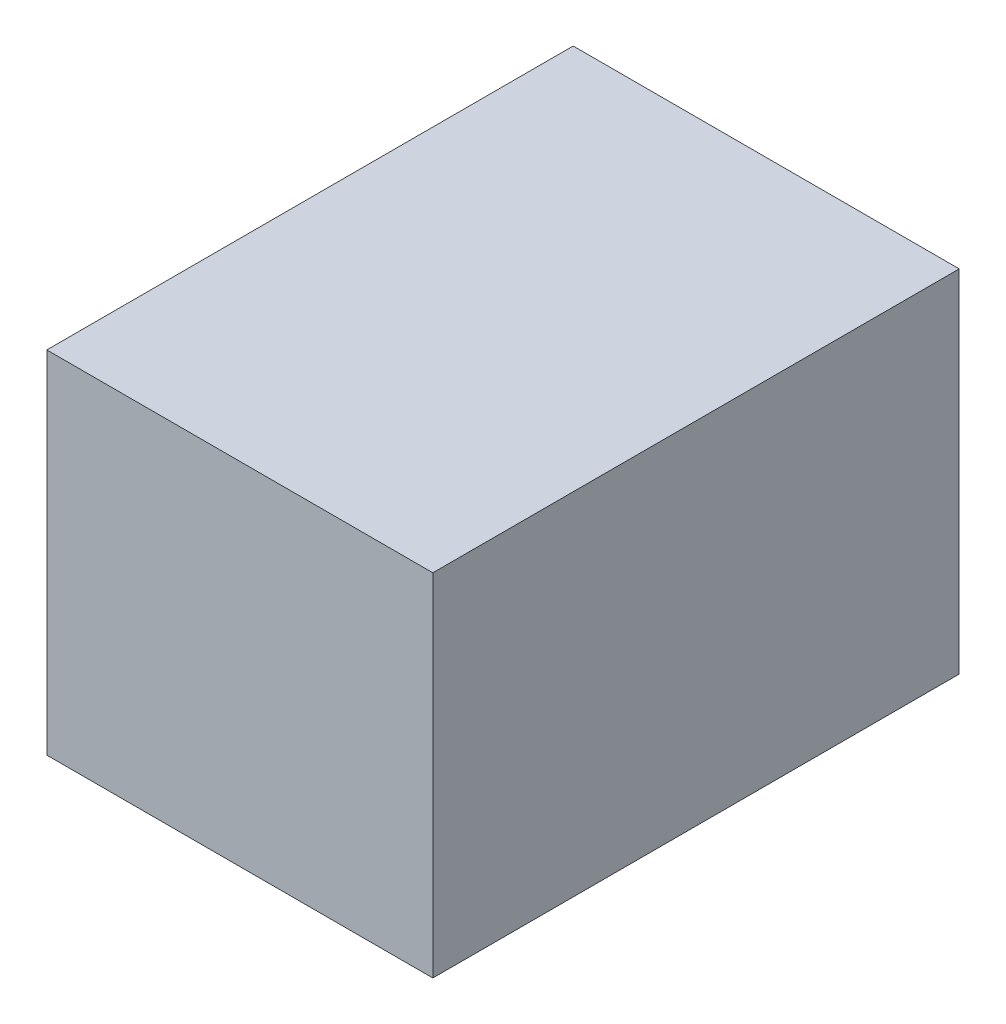
ISO-10303-21;
HEADER;
FILE_DESCRIPTION(('STEP AP214'),'2;1');
FILE_NAME('part.step','',(''),(''),'','','');
FILE_SCHEMA(('AUTOMOTIVE_DESIGN { 1 0 10303 214 1 1 1 1 }'));
ENDSEC;
DATA;
#1=APPLICATION_CONTEXT('core data for automotive mechanical design processes');
#2=APPLICATION_PROTOCOL_DEFINITION('international standard','automotive_design',2000,#1);
#3=PRODUCT_CONTEXT('',#1,'mechanical');
#4=PRODUCT('Part','Part','',(#3));
#5=PRODUCT_RELATED_PRODUCT_CATEGORY('part','',(#4));
#6=PRODUCT_DEFINITION_FORMATION('','',#4);
#7=PRODUCT_DEFINITION_CONTEXT('part definition',#1,'design');
#8=PRODUCT_DEFINITION('design','',#6,#7);
#9=PRODUCT_DEFINITION_SHAPE('','',#8);
#10=(LENGTH_UNIT() NAMED_UNIT(*) SI_UNIT(.MILLI.,.METRE.));
#11=(NAMED_UNIT(*) PLANE_ANGLE_UNIT() SI_UNIT($,.RADIAN.));
#12=(NAMED_UNIT(*) SI_UNIT($,.STERADIAN.) SOLID_ANGLE_UNIT());
#13=UNCERTAINTY_MEASURE_WITH_UNIT(LENGTH_MEASURE(1.E-05),#10,'distance_accuracy_value','');
#14=(GEOMETRIC_REPRESENTATION_CONTEXT(3) GLOBAL_UNCERTAINTY_ASSIGNED_CONTEXT((#13)) GLOBAL_UNIT_ASSIGNED_CONTEXT((#10,
#11,#12)) REPRESENTATION_CONTEXT('',''));
#15=CARTESIAN_POINT('',(0.,0.,0.));
#16=DIRECTION('',(0.,0.,1.));
#17=DIRECTION('',(1.,0.,0.));
#18=AXIS2_PLACEMENT_3D('',#15,#16,#17);
#19=CARTESIAN_POINT('',(15.284562046495,10.,6.6637704722636));
#20=DIRECTION('',(-1.,0.,0.));
#21=DIRECTION('',(0.,0.,1.));
#22=AXIS2_PLACEMENT_3D('',#19,#20,#21);
#23=PLANE('',#22);
#24=DIRECTION('',(0.,0.,-1.));
#25=VECTOR('',#24,1.);
#26=CARTESIAN_POINT('',(15.284562046495,0.,6.6637704722636));
#27=LINE('',#26,#25);
#28=CARTESIAN_POINT('',(15.284562046495,0.,21.6637704722636));
#29=VERTEX_POINT('',#28);
#30=CARTESIAN_POINT('',(15.284562046495,0.,6.6637704722636));
#31=VERTEX_POINT('',#30);
#32=EDGE_CURVE('E113',#29,#31,#27,.T.);
#33=ORIENTED_EDGE('',*,*,#32,.T.);
#34=DIRECTION('',(0.,-1.,0.));
#35=VECTOR('',#34,1.);
#36=CARTESIAN_POINT('',(15.284562046495,10.,6.6637704722636));
#37=LINE('',#36,#35);
#38=CARTESIAN_POINT('',(15.284562046495,10.,6.6637704722636));
#39=VERTEX_POINT('',#38);
#40=EDGE_CURVE('E11',#39,#31,#37,.T.);
#41=ORIENTED_EDGE('',*,*,#40,.F.);
#42=DIRECTION('',(0.,0.,-1.));
#43=VECTOR('',#42,1.);
#44=CARTESIAN_POINT('',(15.284562046495,10.,6.6637704722636));
#45=LINE('',#44,#43);
#46=CARTESIAN_POINT('',(15.284562046495,10.,21.6637704722636));
#47=VERTEX_POINT('',#46);
#48=EDGE_CURVE('E97',#47,#39,#45,.T.);
#49=ORIENTED_EDGE('',*,*,#48,.F.);
#50=DIRECTION('',(0.,-1.,0.));
#51=VECTOR('',#50,1.);
#52=CARTESIAN_POINT('',(15.284562046495,10.,21.6637704722636));
#53=LINE('',#52,#51);
#54=EDGE_CURVE('E109',#47,#29,#53,.T.);
#55=ORIENTED_EDGE('',*,*,#54,.T.);
#56=EDGE_LOOP('',(#33,#41,#49,#55));
#57=FACE_BOUND('',#56,.T.);
#58=ADVANCED_FACE('F45',(#57),#23,.F.);
#59=CARTESIAN_POINT('',(4.28456204649499,10.,6.6637704722636));
#60=DIRECTION('',(0.,0.,1.));
#61=DIRECTION('',(1.,0.,0.));
#62=AXIS2_PLACEMENT_3D('',#59,#60,#61);
#63=PLANE('',#62);
#64=DIRECTION('',(-1.,0.,0.));
#65=VECTOR('',#64,1.);
#66=CARTESIAN_POINT('',(4.28456204649499,0.,6.6637704722636));
#67=LINE('',#66,#65);
#68=CARTESIAN_POINT('',(4.28456204649499,0.,6.6637704722636));
#69=VERTEX_POINT('',#68);
#70=EDGE_CURVE('E102',#31,#69,#67,.T.);
#71=ORIENTED_EDGE('',*,*,#70,.T.);
#72=DIRECTION('',(0.,-1.,0.));
#73=VECTOR('',#72,1.);
#74=CARTESIAN_POINT('',(4.28456204649499,10.,6.6637704722636));
#75=LINE('',#74,#73);
#76=CARTESIAN_POINT('',(4.28456204649499,10.,6.6637704722636));
#77=VERTEX_POINT('',#76);
#78=EDGE_CURVE('E54',#77,#69,#75,.T.);
#79=ORIENTED_EDGE('',*,*,#78,.F.);
#80=DIRECTION('',(-1.,0.,0.));
#81=VECTOR('',#80,1.);
#82=CARTESIAN_POINT('',(4.28456204649499,10.,6.6637704722636));
#83=LINE('',#82,#81);
#84=EDGE_CURVE('E92',#39,#77,#83,.T.);
#85=ORIENTED_EDGE('',*,*,#84,.F.);
#86=ORIENTED_EDGE('',*,*,#40,.T.);
#87=EDGE_LOOP('',(#71,#79,#85,#86));
#88=FACE_BOUND('',#87,.T.);
#89=ADVANCED_FACE('F101',(#88),#63,.F.);
#90=CARTESIAN_POINT('',(4.28456204649499,10.,6.6637704722636));
#91=DIRECTION('',(1.,0.,0.));
#92=DIRECTION('',(0.,0.,-1.));
#93=AXIS2_PLACEMENT_3D('',#90,#91,#92);
#94=PLANE('',#93);
#95=DIRECTION('',(0.,0.,1.));
#96=VECTOR('',#95,1.);
#97=CARTESIAN_POINT('',(4.28456204649499,0.,6.6637704722636));
#98=LINE('',#97,#96);
#99=CARTESIAN_POINT('',(4.28456204649499,0.,21.6637704722636));
#100=VERTEX_POINT('',#99);
#101=EDGE_CURVE('E79',#69,#100,#98,.T.);
#102=ORIENTED_EDGE('',*,*,#101,.T.);
#103=DIRECTION('',(0.,-1.,0.));
#104=VECTOR('',#103,1.);
#105=CARTESIAN_POINT('',(4.28456204649499,10.,21.6637704722636));
#106=LINE('',#105,#104);
#107=CARTESIAN_POINT('',(4.28456204649499,10.,21.6637704722636));
#108=VERTEX_POINT('',#107);
#109=EDGE_CURVE('E104',#108,#100,#106,.T.);
#110=ORIENTED_EDGE('',*,*,#109,.F.);
#111=DIRECTION('',(0.,0.,1.));
#112=VECTOR('',#111,1.);
#113=CARTESIAN_POINT('',(4.28456204649499,10.,6.6637704722636));
#114=LINE('',#113,#112);
#115=EDGE_CURVE('E95',#77,#108,#114,.T.);
#116=ORIENTED_EDGE('',*,*,#115,.F.);
#117=ORIENTED_EDGE('',*,*,#78,.T.);
#118=EDGE_LOOP('',(#102,#110,#116,#117));
#119=FACE_BOUND('',#118,.T.);
#120=ADVANCED_FACE('F105',(#119),#94,.F.);
#121=CARTESIAN_POINT('',(4.28456204649499,10.,21.6637704722636));
#122=DIRECTION('',(0.,0.,-1.));
#123=DIRECTION('',(-1.,0.,0.));
#124=AXIS2_PLACEMENT_3D('',#121,#122,#123);
#125=PLANE('',#124);
#126=DIRECTION('',(1.,0.,0.));
#127=VECTOR('',#126,1.);
#128=CARTESIAN_POINT('',(4.28456204649499,0.,21.6637704722636));
#129=LINE('',#128,#127);
#130=EDGE_CURVE('E85',#100,#29,#129,.T.);
#131=ORIENTED_EDGE('',*,*,#130,.T.);
#132=ORIENTED_EDGE('',*,*,#54,.F.);
#133=DIRECTION('',(1.,0.,0.));
#134=VECTOR('',#133,1.);
#135=CARTESIAN_POINT('',(4.28456204649499,10.,21.6637704722636));
#136=LINE('',#135,#134);
#137=EDGE_CURVE('E62',#108,#47,#136,.T.);
#138=ORIENTED_EDGE('',*,*,#137,.F.);
#139=ORIENTED_EDGE('',*,*,#109,.T.);
#140=EDGE_LOOP('',(#131,#132,#138,#139));
#141=FACE_BOUND('',#140,.T.);
#142=ADVANCED_FACE('F126',(#141),#125,.F.);
#143=CARTESIAN_POINT('',(0.,10.,0.));
#144=DIRECTION('',(0.,1.,0.));
#145=DIRECTION('',(0.,0.,1.));
#146=AXIS2_PLACEMENT_3D('',#143,#144,#145);
#147=PLANE('',#146);
#148=ORIENTED_EDGE('',*,*,#48,.T.);
#149=ORIENTED_EDGE('',*,*,#84,.T.);
#150=ORIENTED_EDGE('',*,*,#115,.T.);
#151=ORIENTED_EDGE('',*,*,#137,.T.);
#152=EDGE_LOOP('',(#148,#149,#150,#151));
#153=FACE_BOUND('',#152,.T.);
#154=ADVANCED_FACE('F93',(#153),#147,.T.);
#155=CARTESIAN_POINT('',(0.,0.,0.));
#156=DIRECTION('',(0.,1.,0.));
#157=DIRECTION('',(0.,0.,1.));
#158=AXIS2_PLACEMENT_3D('',#155,#156,#157);
#159=PLANE('',#158);
#160=ORIENTED_EDGE('',*,*,#32,.F.);
#161=ORIENTED_EDGE('',*,*,#130,.F.);
#162=ORIENTED_EDGE('',*,*,#101,.F.);
#163=ORIENTED_EDGE('',*,*,#70,.F.);
#164=EDGE_LOOP('',(#160,#161,#162,#163));
#165=FACE_BOUND('',#164,.T.);
#166=ADVANCED_FACE('F129',(#165),#159,.F.);
#167=CLOSED_SHELL('',(#58,#89,#120,#142,#154,#166));
#168=MANIFOLD_SOLID_BREP('B2',#167);
#169=ADVANCED_BREP_SHAPE_REPRESENTATION('',(#18,#168),#14);
#170=SHAPE_DEFINITION_REPRESENTATION(#9,#169);
ENDSEC;
END-ISO-10303-21;
